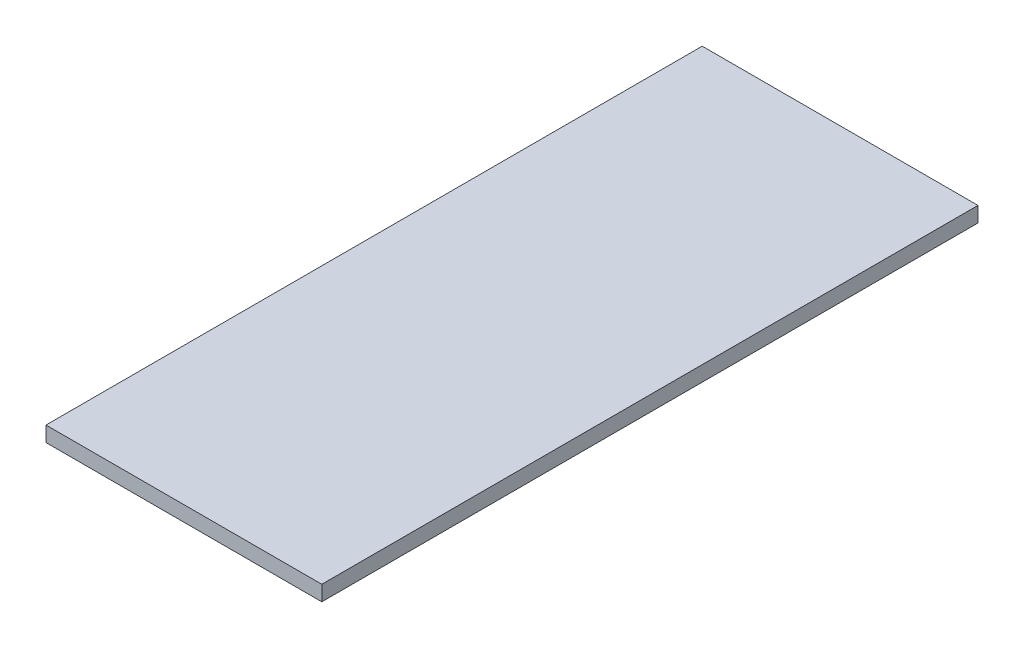
ISO-10303-21;
HEADER;
FILE_DESCRIPTION(('STEP AP214'),'2;1');
FILE_NAME('part.step','',(''),(''),'','','');
FILE_SCHEMA(('AUTOMOTIVE_DESIGN { 1 0 10303 214 1 1 1 1 }'));
ENDSEC;
DATA;
#1=APPLICATION_CONTEXT('core data for automotive mechanical design processes');
#2=APPLICATION_PROTOCOL_DEFINITION('international standard','automotive_design',2000,#1);
#3=PRODUCT_CONTEXT('',#1,'mechanical');
#4=PRODUCT('Part','Part','',(#3));
#5=PRODUCT_RELATED_PRODUCT_CATEGORY('part','',(#4));
#6=PRODUCT_DEFINITION_FORMATION('','',#4);
#7=PRODUCT_DEFINITION_CONTEXT('part definition',#1,'design');
#8=PRODUCT_DEFINITION('design','',#6,#7);
#9=PRODUCT_DEFINITION_SHAPE('','',#8);
#10=(LENGTH_UNIT() NAMED_UNIT(*) SI_UNIT(.MILLI.,.METRE.));
#11=(NAMED_UNIT(*) PLANE_ANGLE_UNIT() SI_UNIT($,.RADIAN.));
#12=(NAMED_UNIT(*) SI_UNIT($,.STERADIAN.) SOLID_ANGLE_UNIT());
#13=UNCERTAINTY_MEASURE_WITH_UNIT(LENGTH_MEASURE(1.E-05),#10,'distance_accuracy_value','');
#14=(GEOMETRIC_REPRESENTATION_CONTEXT(3) GLOBAL_UNCERTAINTY_ASSIGNED_CONTEXT((#13)) GLOBAL_UNIT_ASSIGNED_CONTEXT((#10,
#11,#12)) REPRESENTATION_CONTEXT('',''));
#15=CARTESIAN_POINT('',(0.,0.,0.));
#16=DIRECTION('',(0.,0.,1.));
#17=DIRECTION('',(1.,0.,0.));
#18=AXIS2_PLACEMENT_3D('',#15,#16,#17);
#19=CARTESIAN_POINT('',(0.,16.,0.));
#20=DIRECTION('',(1.,0.,0.));
#21=DIRECTION('',(0.,0.,-1.));
#22=AXIS2_PLACEMENT_3D('',#19,#20,#21);
#23=PLANE('',#22);
#24=DIRECTION('',(0.,0.,1.));
#25=VECTOR('',#24,1.);
#26=CARTESIAN_POINT('',(0.,0.,0.));
#27=LINE('',#26,#25);
#28=CARTESIAN_POINT('',(0.,0.,-690.));
#29=VERTEX_POINT('',#28);
#30=CARTESIAN_POINT('',(0.,0.,0.));
#31=VERTEX_POINT('',#30);
#32=EDGE_CURVE('E94',#29,#31,#27,.T.);
#33=ORIENTED_EDGE('',*,*,#32,.T.);
#34=DIRECTION('',(0.,-1.,0.));
#35=VECTOR('',#34,1.);
#36=CARTESIAN_POINT('',(0.,16.,0.));
#37=LINE('',#36,#35);
#38=CARTESIAN_POINT('',(0.,16.,0.));
#39=VERTEX_POINT('',#38);
#40=EDGE_CURVE('E11',#39,#31,#37,.T.);
#41=ORIENTED_EDGE('',*,*,#40,.F.);
#42=DIRECTION('',(0.,0.,1.));
#43=VECTOR('',#42,1.);
#44=CARTESIAN_POINT('',(0.,16.,0.));
#45=LINE('',#44,#43);
#46=CARTESIAN_POINT('',(0.,16.,-690.));
#47=VERTEX_POINT('',#46);
#48=EDGE_CURVE('E82',#47,#39,#45,.T.);
#49=ORIENTED_EDGE('',*,*,#48,.F.);
#50=DIRECTION('',(0.,-1.,0.));
#51=VECTOR('',#50,1.);
#52=CARTESIAN_POINT('',(0.,16.,-690.));
#53=LINE('',#52,#51);
#54=EDGE_CURVE('E90',#47,#29,#53,.T.);
#55=ORIENTED_EDGE('',*,*,#54,.T.);
#56=EDGE_LOOP('',(#33,#41,#49,#55));
#57=FACE_BOUND('',#56,.T.);
#58=ADVANCED_FACE('F31',(#57),#23,.F.);
#59=CARTESIAN_POINT('',(0.,16.,0.));
#60=DIRECTION('',(0.,0.,-1.));
#61=DIRECTION('',(-1.,0.,0.));
#62=AXIS2_PLACEMENT_3D('',#59,#60,#61);
#63=PLANE('',#62);
#64=DIRECTION('',(1.,0.,0.));
#65=VECTOR('',#64,1.);
#66=CARTESIAN_POINT('',(0.,0.,0.));
#67=LINE('',#66,#65);
#68=CARTESIAN_POINT('',(290.,0.,0.));
#69=VERTEX_POINT('',#68);
#70=EDGE_CURVE('E86',#31,#69,#67,.T.);
#71=ORIENTED_EDGE('',*,*,#70,.T.);
#72=DIRECTION('',(0.,-1.,0.));
#73=VECTOR('',#72,1.);
#74=CARTESIAN_POINT('',(290.,16.,0.));
#75=LINE('',#74,#73);
#76=CARTESIAN_POINT('',(290.,16.,0.));
#77=VERTEX_POINT('',#76);
#78=EDGE_CURVE('E39',#77,#69,#75,.T.);
#79=ORIENTED_EDGE('',*,*,#78,.F.);
#80=DIRECTION('',(1.,0.,0.));
#81=VECTOR('',#80,1.);
#82=CARTESIAN_POINT('',(0.,16.,0.));
#83=LINE('',#82,#81);
#84=EDGE_CURVE('E77',#39,#77,#83,.T.);
#85=ORIENTED_EDGE('',*,*,#84,.F.);
#86=ORIENTED_EDGE('',*,*,#40,.T.);
#87=EDGE_LOOP('',(#71,#79,#85,#86));
#88=FACE_BOUND('',#87,.T.);
#89=ADVANCED_FACE('F85',(#88),#63,.F.);
#90=CARTESIAN_POINT('',(290.,16.,0.));
#91=DIRECTION('',(-1.,0.,0.));
#92=DIRECTION('',(0.,0.,1.));
#93=AXIS2_PLACEMENT_3D('',#90,#91,#92);
#94=PLANE('',#93);
#95=DIRECTION('',(0.,0.,-1.));
#96=VECTOR('',#95,1.);
#97=CARTESIAN_POINT('',(290.,0.,0.));
#98=LINE('',#97,#96);
#99=CARTESIAN_POINT('',(290.,0.,-690.));
#100=VERTEX_POINT('',#99);
#101=EDGE_CURVE('E64',#69,#100,#98,.T.);
#102=ORIENTED_EDGE('',*,*,#101,.T.);
#103=DIRECTION('',(0.,-1.,0.));
#104=VECTOR('',#103,1.);
#105=CARTESIAN_POINT('',(290.,16.,-690.));
#106=LINE('',#105,#104);
#107=CARTESIAN_POINT('',(290.,16.,-690.));
#108=VERTEX_POINT('',#107);
#109=EDGE_CURVE('E87',#108,#100,#106,.T.);
#110=ORIENTED_EDGE('',*,*,#109,.F.);
#111=DIRECTION('',(0.,0.,-1.));
#112=VECTOR('',#111,1.);
#113=CARTESIAN_POINT('',(290.,16.,0.));
#114=LINE('',#113,#112);
#115=EDGE_CURVE('E80',#77,#108,#114,.T.);
#116=ORIENTED_EDGE('',*,*,#115,.F.);
#117=ORIENTED_EDGE('',*,*,#78,.T.);
#118=EDGE_LOOP('',(#102,#110,#116,#117));
#119=FACE_BOUND('',#118,.T.);
#120=ADVANCED_FACE('F88',(#119),#94,.F.);
#121=CARTESIAN_POINT('',(0.,16.,-690.));
#122=DIRECTION('',(0.,0.,1.));
#123=DIRECTION('',(1.,0.,0.));
#124=AXIS2_PLACEMENT_3D('',#121,#122,#123);
#125=PLANE('',#124);
#126=DIRECTION('',(-1.,0.,0.));
#127=VECTOR('',#126,1.);
#128=CARTESIAN_POINT('',(0.,0.,-690.));
#129=LINE('',#128,#127);
#130=EDGE_CURVE('E70',#100,#29,#129,.T.);
#131=ORIENTED_EDGE('',*,*,#130,.T.);
#132=ORIENTED_EDGE('',*,*,#54,.F.);
#133=DIRECTION('',(-1.,0.,0.));
#134=VECTOR('',#133,1.);
#135=CARTESIAN_POINT('',(0.,16.,-690.));
#136=LINE('',#135,#134);
#137=EDGE_CURVE('E47',#108,#47,#136,.T.);
#138=ORIENTED_EDGE('',*,*,#137,.F.);
#139=ORIENTED_EDGE('',*,*,#109,.T.);
#140=EDGE_LOOP('',(#131,#132,#138,#139));
#141=FACE_BOUND('',#140,.T.);
#142=ADVANCED_FACE('F101',(#141),#125,.F.);
#143=CARTESIAN_POINT('',(0.,16.,-690.));
#144=DIRECTION('',(0.,-1.,0.));
#145=DIRECTION('',(0.,0.,-1.));
#146=AXIS2_PLACEMENT_3D('',#143,#144,#145);
#147=PLANE('',#146);
#148=ORIENTED_EDGE('',*,*,#48,.T.);
#149=ORIENTED_EDGE('',*,*,#84,.T.);
#150=ORIENTED_EDGE('',*,*,#115,.T.);
#151=ORIENTED_EDGE('',*,*,#137,.T.);
#152=EDGE_LOOP('',(#148,#149,#150,#151));
#153=FACE_BOUND('',#152,.T.);
#154=ADVANCED_FACE('F78',(#153),#147,.F.);
#155=CARTESIAN_POINT('',(0.,0.,-690.));
#156=DIRECTION('',(0.,-1.,0.));
#157=DIRECTION('',(0.,0.,-1.));
#158=AXIS2_PLACEMENT_3D('',#155,#156,#157);
#159=PLANE('',#158);
#160=ORIENTED_EDGE('',*,*,#32,.F.);
#161=ORIENTED_EDGE('',*,*,#130,.F.);
#162=ORIENTED_EDGE('',*,*,#101,.F.);
#163=ORIENTED_EDGE('',*,*,#70,.F.);
#164=EDGE_LOOP('',(#160,#161,#162,#163));
#165=FACE_BOUND('',#164,.T.);
#166=ADVANCED_FACE('F104',(#165),#159,.T.);
#167=CLOSED_SHELL('',(#58,#89,#120,#142,#154,#166));
#168=MANIFOLD_SOLID_BREP('B2',#167);
#169=ADVANCED_BREP_SHAPE_REPRESENTATION('',(#18,#168),#14);
#170=SHAPE_DEFINITION_REPRESENTATION(#9,#169);
ENDSEC;
END-ISO-10303-21;
